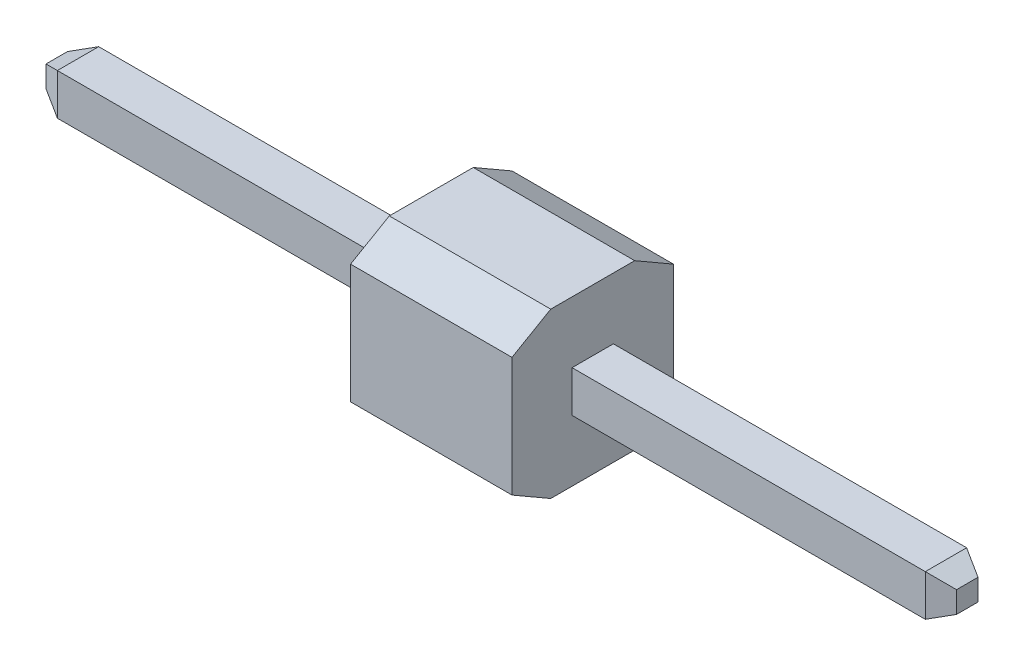
ISO-10303-21;
HEADER;
FILE_DESCRIPTION(('STEP AP214'),'2;1');
FILE_NAME('part.step','',(''),(''),'','','');
FILE_SCHEMA(('AUTOMOTIVE_DESIGN { 1 0 10303 214 1 1 1 1 }'));
ENDSEC;
DATA;
#1=APPLICATION_CONTEXT('core data for automotive mechanical design processes');
#2=APPLICATION_PROTOCOL_DEFINITION('international standard','automotive_design',2000,#1);
#3=PRODUCT_CONTEXT('',#1,'mechanical');
#4=PRODUCT('Part','Part','',(#3));
#5=PRODUCT_RELATED_PRODUCT_CATEGORY('part','',(#4));
#6=PRODUCT_DEFINITION_FORMATION('','',#4);
#7=PRODUCT_DEFINITION_CONTEXT('part definition',#1,'design');
#8=PRODUCT_DEFINITION('design','',#6,#7);
#9=PRODUCT_DEFINITION_SHAPE('','',#8);
#10=(LENGTH_UNIT() NAMED_UNIT(*) SI_UNIT(.MILLI.,.METRE.));
#11=(NAMED_UNIT(*) PLANE_ANGLE_UNIT() SI_UNIT($,.RADIAN.));
#12=(NAMED_UNIT(*) SI_UNIT($,.STERADIAN.) SOLID_ANGLE_UNIT());
#13=UNCERTAINTY_MEASURE_WITH_UNIT(LENGTH_MEASURE(1.E-05),#10,'distance_accuracy_value','');
#14=(GEOMETRIC_REPRESENTATION_CONTEXT(3) GLOBAL_UNCERTAINTY_ASSIGNED_CONTEXT((#13)) GLOBAL_UNIT_ASSIGNED_CONTEXT((#10,
#11,#12)) REPRESENTATION_CONTEXT('',''));
#15=CARTESIAN_POINT('',(0.,0.,0.));
#16=DIRECTION('',(0.,0.,1.));
#17=DIRECTION('',(1.,0.,0.));
#18=AXIS2_PLACEMENT_3D('',#15,#16,#17);
#19=CARTESIAN_POINT('',(5.42107691384192,13.0171157260571,-2.77112170583403));
#20=DIRECTION('',(1.,-9.93476518829084E-08,4.37113882867379E-08));
#21=DIRECTION('',(-9.93476589883358E-08,-1.,8.74227765734759E-08));
#22=AXIS2_PLACEMENT_3D('',#19,#20,#21);
#23=PLANE('',#22);
#24=DIRECTION('',(-1.18186632779335E-08,-0.50000007571054,-0.866025360072934));
#25=VECTOR('',#24,1.);
#26=CARTESIAN_POINT('',(5.42107672166731,11.7735260248209,-1.20112159711595));
#27=LINE('',#26,#25);
#28=CARTESIAN_POINT('',(5.42107672166731,11.7735260248209,-1.20112159711595));
#29=VERTEX_POINT('',#28);
#30=CARTESIAN_POINT('',(5.4210767134791,11.4271158108572,-1.80112156683181));
#31=VERTEX_POINT('',#30);
#32=EDGE_CURVE('E11',#29,#31,#27,.T.);
#33=ORIENTED_EDGE('',*,*,#32,.T.);
#34=DIRECTION('',(4.37113811813104E-08,-8.74227842254741E-08,-0.999999999999995));
#35=VECTOR('',#34,1.);
#36=CARTESIAN_POINT('',(5.4210767134791,11.4271158108572,-1.80112156683181));
#37=LINE('',#36,#35);
#38=CARTESIAN_POINT('',(5.42107677030389,11.4271156972076,-3.10112156683181));
#39=VERTEX_POINT('',#38);
#40=EDGE_CURVE('E304',#31,#39,#37,.T.);
#41=ORIENTED_EDGE('',*,*,#40,.T.);
#42=DIRECTION('',(8.75289963531793E-08,0.499999924289839,-0.866025447495712));
#43=VECTOR('',#42,1.);
#44=CARTESIAN_POINT('',(5.42107677030389,11.4271156972076,-3.10112156683181));
#45=LINE('',#44,#43);
#46=CARTESIAN_POINT('',(5.42107683094576,11.773525806264,-3.70112159711595));
#47=VERTEX_POINT('',#46);
#48=EDGE_CURVE('E296',#39,#47,#45,.T.);
#49=ORIENTED_EDGE('',*,*,#48,.T.);
#50=DIRECTION('',(9.93476588436478E-08,0.999999999999991,-8.74227764822788E-08));
#51=VECTOR('',#50,1.);
#52=CARTESIAN_POINT('',(5.42107683094576,11.773525806264,-3.70112159711595));
#53=LINE('',#52,#51);
#54=CARTESIAN_POINT('',(5.42107701445874,13.620705483234,-3.70112175860153));
#55=VERTEX_POINT('',#54);
#56=EDGE_CURVE('E281',#47,#55,#53,.T.);
#57=ORIENTED_EDGE('',*,*,#56,.T.);
#58=DIRECTION('',(-1.18186632778483E-08,-0.500000075710537,-0.866025360072935));
#59=VECTOR('',#58,1.);
#60=CARTESIAN_POINT('',(5.42107702264695,13.9671156972076,-3.10112178888567));
#61=LINE('',#60,#59);
#62=CARTESIAN_POINT('',(5.42107702264695,13.9671156972076,-3.10112178888567));
#63=VERTEX_POINT('',#62);
#64=EDGE_CURVE('E265',#63,#55,#61,.T.);
#65=ORIENTED_EDGE('',*,*,#64,.F.);
#66=DIRECTION('',(4.37113811813104E-08,-8.74227842254741E-08,-0.999999999999995));
#67=VECTOR('',#66,1.);
#68=CARTESIAN_POINT('',(5.42107696582215,13.9671158108572,-1.80112178888567));
#69=LINE('',#68,#67);
#70=CARTESIAN_POINT('',(5.42107696582215,13.9671158108572,-1.80112178888567));
#71=VERTEX_POINT('',#70);
#72=EDGE_CURVE('E248',#71,#63,#69,.T.);
#73=ORIENTED_EDGE('',*,*,#72,.F.);
#74=DIRECTION('',(8.75289963525477E-08,0.499999924289836,-0.866025447495714));
#75=VECTOR('',#74,1.);
#76=CARTESIAN_POINT('',(5.42107690518028,13.6207057017909,-1.20112175860153));
#77=LINE('',#76,#75);
#78=CARTESIAN_POINT('',(5.42107690518028,13.6207057017909,-1.20112175860153));
#79=VERTEX_POINT('',#78);
#80=EDGE_CURVE('E242',#79,#71,#77,.T.);
#81=ORIENTED_EDGE('',*,*,#80,.F.);
#82=DIRECTION('',(9.93476588436478E-08,0.999999999999991,-8.74227763620714E-08));
#83=VECTOR('',#82,1.);
#84=CARTESIAN_POINT('',(5.42107672166731,11.7735260248209,-1.20112159711595));
#85=LINE('',#84,#83);
#86=EDGE_CURVE('E236',#29,#79,#85,.T.);
#87=ORIENTED_EDGE('',*,*,#86,.F.);
#88=EDGE_LOOP('',(#33,#41,#49,#57,#65,#73,#81,#87));
#89=FACE_BOUND('',#88,.T.);
#90=DIRECTION('',(-4.37113803486431E-08,8.74227856773042E-08,0.999999999999995));
#91=VECTOR('',#90,1.);
#92=CARTESIAN_POINT('',(5.42107685025941,12.3771157260571,-2.77112164988345));
#93=LINE('',#92,#91);
#94=CARTESIAN_POINT('',(5.42107685025941,12.3771157260571,-2.77112164988345));
#95=VERTEX_POINT('',#94);
#96=CARTESIAN_POINT('',(5.42107682228413,12.3771157820077,-2.13112164988345));
#97=VERTEX_POINT('',#96);
#98=EDGE_CURVE('E302',#95,#97,#93,.T.);
#99=ORIENTED_EDGE('',*,*,#98,.T.);
#100=DIRECTION('',(-9.93476578781123E-08,-0.999999999999991,8.74227766567422E-08));
#101=VECTOR('',#100,1.);
#102=CARTESIAN_POINT('',(5.42107688586663,13.0171157820077,-2.13112170583403));
#103=LINE('',#102,#101);
#104=CARTESIAN_POINT('',(5.42107688586663,13.0171157820077,-2.13112170583403));
#105=VERTEX_POINT('',#104);
#106=EDGE_CURVE('E293',#105,#97,#103,.T.);
#107=ORIENTED_EDGE('',*,*,#106,.F.);
#108=DIRECTION('',(-4.37113817364219E-08,8.74227856773042E-08,0.999999999999995));
#109=VECTOR('',#108,1.);
#110=CARTESIAN_POINT('',(5.42107691384192,13.0171157260571,-2.77112170583403));
#111=LINE('',#110,#109);
#112=CARTESIAN_POINT('',(5.42107691384192,13.0171157260571,-2.77112170583403));
#113=VERTEX_POINT('',#112);
#114=EDGE_CURVE('E278',#113,#105,#111,.T.);
#115=ORIENTED_EDGE('',*,*,#114,.F.);
#116=DIRECTION('',(-9.93476592658911E-08,-0.999999999999991,8.74227766567422E-08));
#117=VECTOR('',#116,1.);
#118=CARTESIAN_POINT('',(5.42107691384192,13.0171157260571,-2.77112170583403));
#119=LINE('',#118,#117);
#120=EDGE_CURVE('E263',#113,#95,#119,.T.);
#121=ORIENTED_EDGE('',*,*,#120,.T.);
#122=EDGE_LOOP('',(#99,#107,#115,#121));
#123=FACE_BOUND('',#122,.T.);
#124=ADVANCED_FACE('F17',(#89,#123),#23,.T.);
#125=CARTESIAN_POINT('',(2.92107691384192,13.0171159744263,-2.7711218151125));
#126=DIRECTION('',(1.,-9.93476518829084E-08,4.37113882867379E-08));
#127=DIRECTION('',(-9.93476589883358E-08,-1.,8.74227765734759E-08));
#128=AXIS2_PLACEMENT_3D('',#125,#126,#127);
#129=PLANE('',#128);
#130=DIRECTION('',(-1.1818662636946E-08,-0.50000007571054,-0.866025360072934));
#131=VECTOR('',#130,1.);
#132=CARTESIAN_POINT('',(2.92107672166731,11.77352627319,-1.20112170639442));
#133=LINE('',#132,#131);
#134=CARTESIAN_POINT('',(2.92107672166731,11.77352627319,-1.20112170639442));
#135=VERTEX_POINT('',#134);
#136=CARTESIAN_POINT('',(2.9210767134791,11.4271160592264,-1.80112167611028));
#137=VERTEX_POINT('',#136);
#138=EDGE_CURVE('E24',#135,#137,#133,.T.);
#139=ORIENTED_EDGE('',*,*,#138,.F.);
#140=DIRECTION('',(9.93476590840625E-08,0.999999999999991,-8.74227763620714E-08));
#141=VECTOR('',#140,1.);
#142=CARTESIAN_POINT('',(2.92107672166731,11.77352627319,-1.20112170639442));
#143=LINE('',#142,#141);
#144=CARTESIAN_POINT('',(2.92107690518028,13.62070595016,-1.20112186788));
#145=VERTEX_POINT('',#144);
#146=EDGE_CURVE('E300',#135,#145,#143,.T.);
#147=ORIENTED_EDGE('',*,*,#146,.T.);
#148=DIRECTION('',(8.75289957115602E-08,0.499999924289836,-0.866025447495714));
#149=VECTOR('',#148,1.);
#150=CARTESIAN_POINT('',(2.92107690518028,13.62070595016,-1.20112186788));
#151=LINE('',#150,#149);
#152=CARTESIAN_POINT('',(2.92107696582215,13.9671160592264,-1.80112189816414));
#153=VERTEX_POINT('',#152);
#154=EDGE_CURVE('E286',#145,#153,#151,.T.);
#155=ORIENTED_EDGE('',*,*,#154,.T.);
#156=DIRECTION('',(4.37113811813104E-08,-8.74227842254741E-08,-0.999999999999995));
#157=VECTOR('',#156,1.);
#158=CARTESIAN_POINT('',(2.92107696582215,13.9671160592264,-1.80112189816414));
#159=LINE('',#158,#157);
#160=CARTESIAN_POINT('',(2.92107702264695,13.9671159455768,-3.10112189816414));
#161=VERTEX_POINT('',#160);
#162=EDGE_CURVE('E271',#153,#161,#159,.T.);
#163=ORIENTED_EDGE('',*,*,#162,.T.);
#164=DIRECTION('',(-1.18186626368607E-08,-0.500000075710537,-0.866025360072935));
#165=VECTOR('',#164,1.);
#166=CARTESIAN_POINT('',(2.92107702264695,13.9671159455768,-3.10112189816414));
#167=LINE('',#166,#165);
#168=CARTESIAN_POINT('',(2.92107701445874,13.6207057316031,-3.70112186788));
#169=VERTEX_POINT('',#168);
#170=EDGE_CURVE('E253',#161,#169,#167,.T.);
#171=ORIENTED_EDGE('',*,*,#170,.T.);
#172=DIRECTION('',(9.93476590840625E-08,0.999999999999991,-8.74227764822788E-08));
#173=VECTOR('',#172,1.);
#174=CARTESIAN_POINT('',(2.92107683094576,11.7735260546331,-3.70112170639442));
#175=LINE('',#174,#173);
#176=CARTESIAN_POINT('',(2.92107683094576,11.7735260546331,-3.70112170639442));
#177=VERTEX_POINT('',#176);
#178=EDGE_CURVE('E261',#177,#169,#175,.T.);
#179=ORIENTED_EDGE('',*,*,#178,.F.);
#180=DIRECTION('',(8.75289957121918E-08,0.499999924289839,-0.866025447495712));
#181=VECTOR('',#180,1.);
#182=CARTESIAN_POINT('',(2.92107677030389,11.4271159455767,-3.10112167611028));
#183=LINE('',#182,#181);
#184=CARTESIAN_POINT('',(2.92107677030389,11.4271159455767,-3.10112167611028));
#185=VERTEX_POINT('',#184);
#186=EDGE_CURVE('E276',#185,#177,#183,.T.);
#187=ORIENTED_EDGE('',*,*,#186,.F.);
#188=DIRECTION('',(4.37113811813104E-08,-8.74227842254741E-08,-0.999999999999995));
#189=VECTOR('',#188,1.);
#190=CARTESIAN_POINT('',(2.9210767134791,11.4271160592264,-1.80112167611028));
#191=LINE('',#190,#189);
#192=EDGE_CURVE('E291',#137,#185,#191,.T.);
#193=ORIENTED_EDGE('',*,*,#192,.F.);
#194=EDGE_LOOP('',(#139,#147,#155,#163,#171,#179,#187,#193));
#195=FACE_BOUND('',#194,.T.);
#196=DIRECTION('',(-9.93476592658911E-08,-0.999999999999991,8.74227766567422E-08));
#197=VECTOR('',#196,1.);
#198=CARTESIAN_POINT('',(2.92107688586663,13.0171160303769,-2.1311218151125));
#199=LINE('',#198,#197);
#200=CARTESIAN_POINT('',(2.92107688586663,13.0171160303769,-2.1311218151125));
#201=VERTEX_POINT('',#200);
#202=CARTESIAN_POINT('',(2.92107682228413,12.3771160303769,-2.13112175916192));
#203=VERTEX_POINT('',#202);
#204=EDGE_CURVE('E298',#201,#203,#199,.T.);
#205=ORIENTED_EDGE('',*,*,#204,.T.);
#206=DIRECTION('',(-4.37113810425325E-08,8.74227856773042E-08,0.999999999999995));
#207=VECTOR('',#206,1.);
#208=CARTESIAN_POINT('',(2.92107685025941,12.3771159744263,-2.77112175916192));
#209=LINE('',#208,#207);
#210=CARTESIAN_POINT('',(2.92107685025941,12.3771159744263,-2.77112175916192));
#211=VERTEX_POINT('',#210);
#212=EDGE_CURVE('E283',#211,#203,#209,.T.);
#213=ORIENTED_EDGE('',*,*,#212,.F.);
#214=DIRECTION('',(-9.93476592658911E-08,-0.999999999999991,8.74227766567422E-08));
#215=VECTOR('',#214,1.);
#216=CARTESIAN_POINT('',(2.92107691384192,13.0171159744263,-2.7711218151125));
#217=LINE('',#216,#215);
#218=CARTESIAN_POINT('',(2.92107691384192,13.0171159744263,-2.7711218151125));
#219=VERTEX_POINT('',#218);
#220=EDGE_CURVE('E268',#219,#211,#217,.T.);
#221=ORIENTED_EDGE('',*,*,#220,.F.);
#222=DIRECTION('',(-4.37113810425325E-08,8.74227856773042E-08,0.999999999999995));
#223=VECTOR('',#222,1.);
#224=CARTESIAN_POINT('',(2.92107691384192,13.0171159744263,-2.7711218151125));
#225=LINE('',#224,#223);
#226=EDGE_CURVE('E251',#219,#201,#225,.T.);
#227=ORIENTED_EDGE('',*,*,#226,.T.);
#228=EDGE_LOOP('',(#205,#213,#221,#227));
#229=FACE_BOUND('',#228,.T.);
#230=ADVANCED_FACE('F314',(#195,#229),#129,.F.);
#231=CARTESIAN_POINT('',(5.42107672166731,11.7735260248209,-1.20112159711595));
#232=DIRECTION('',(1.07893287081065E-07,0.866025360072937,-0.500000075710535));
#233=DIRECTION('',(1.18186629566715E-08,0.500000075710542,0.866025360072941));
#234=AXIS2_PLACEMENT_3D('',#231,#232,#233);
#235=PLANE('',#234);
#236=ORIENTED_EDGE('',*,*,#138,.T.);
#237=DIRECTION('',(-0.999999999999994,9.93476533039933E-08,-4.37113883755555E-08));
#238=VECTOR('',#237,1.);
#239=CARTESIAN_POINT('',(5.4210767134791,11.4271158108572,-1.80112156683181));
#240=LINE('',#239,#238);
#241=EDGE_CURVE('E288',#31,#137,#240,.T.);
#242=ORIENTED_EDGE('',*,*,#241,.F.);
#243=ORIENTED_EDGE('',*,*,#32,.F.);
#244=DIRECTION('',(-0.999999999999994,9.93476504618223E-08,-4.3711388109102E-08));
#245=VECTOR('',#244,1.);
#246=CARTESIAN_POINT('',(5.42107672166731,11.7735260248209,-1.20112159711595));
#247=LINE('',#246,#245);
#248=EDGE_CURVE('E256',#29,#135,#247,.T.);
#249=ORIENTED_EDGE('',*,*,#248,.T.);
#250=EDGE_LOOP('',(#236,#242,#243,#249));
#251=FACE_BOUND('',#250,.T.);
#252=ADVANCED_FACE('F306',(#251),#235,.F.);
#253=CARTESIAN_POINT('',(5.4210767134791,11.4271158108572,-1.80112156683181));
#254=DIRECTION('',(9.93476589883358E-08,1.,-8.74227765734759E-08));
#255=DIRECTION('',(1.,-9.93476518829084E-08,4.37113882867379E-08));
#256=AXIS2_PLACEMENT_3D('',#253,#254,#255);
#257=PLANE('',#256);
#258=ORIENTED_EDGE('',*,*,#192,.T.);
#259=DIRECTION('',(-0.999999999999994,9.93476533039933E-08,-4.37113884643734E-08));
#260=VECTOR('',#259,1.);
#261=CARTESIAN_POINT('',(5.42107677030389,11.4271156972076,-3.10112156683181));
#262=LINE('',#261,#260);
#263=EDGE_CURVE('E273',#39,#185,#262,.T.);
#264=ORIENTED_EDGE('',*,*,#263,.F.);
#265=ORIENTED_EDGE('',*,*,#40,.F.);
#266=ORIENTED_EDGE('',*,*,#241,.T.);
#267=EDGE_LOOP('',(#258,#264,#265,#266));
#268=FACE_BOUND('',#267,.T.);
#269=ADVANCED_FACE('F311',(#268),#257,.F.);
#270=CARTESIAN_POINT('',(5.42107677030389,11.4271156972076,-3.10112156683181));
#271=DIRECTION('',(6.41819058997377E-08,0.866025447495721,0.499999924289845));
#272=DIRECTION('',(-8.7528996031702E-08,-0.499999924289838,0.866025447495717));
#273=AXIS2_PLACEMENT_3D('',#270,#271,#272);
#274=PLANE('',#273);
#275=ORIENTED_EDGE('',*,*,#186,.T.);
#276=DIRECTION('',(-0.999999999999994,9.93476504618223E-08,-4.37113882867377E-08));
#277=VECTOR('',#276,1.);
#278=CARTESIAN_POINT('',(5.42107683094576,11.773525806264,-3.70112159711595));
#279=LINE('',#278,#277);
#280=EDGE_CURVE('E258',#47,#177,#279,.T.);
#281=ORIENTED_EDGE('',*,*,#280,.F.);
#282=ORIENTED_EDGE('',*,*,#48,.F.);
#283=ORIENTED_EDGE('',*,*,#263,.T.);
#284=EDGE_LOOP('',(#275,#281,#282,#283));
#285=FACE_BOUND('',#284,.T.);
#286=ADVANCED_FACE('F319',(#285),#274,.F.);
#287=CARTESIAN_POINT('',(5.42107683094576,11.773525806264,-3.70112159711595));
#288=DIRECTION('',(-4.37113811813106E-08,8.74227836789032E-08,1.));
#289=DIRECTION('',(-1.,9.93476518829084E-08,-4.37113882867379E-08));
#290=AXIS2_PLACEMENT_3D('',#287,#288,#289);
#291=PLANE('',#290);
#292=ORIENTED_EDGE('',*,*,#178,.T.);
#293=DIRECTION('',(-0.999999999999994,9.93476533039933E-08,-4.37113884643734E-08));
#294=VECTOR('',#293,1.);
#295=CARTESIAN_POINT('',(5.42107701445874,13.620705483234,-3.70112175860153));
#296=LINE('',#295,#294);
#297=EDGE_CURVE('E245',#55,#169,#296,.T.);
#298=ORIENTED_EDGE('',*,*,#297,.F.);
#299=ORIENTED_EDGE('',*,*,#56,.F.);
#300=ORIENTED_EDGE('',*,*,#280,.T.);
#301=EDGE_LOOP('',(#292,#298,#299,#300));
#302=FACE_BOUND('',#301,.T.);
#303=ADVANCED_FACE('F326',(#302),#291,.F.);
#304=CARTESIAN_POINT('',(5.42107702264695,13.9671156972076,-3.10112178888567));
#305=DIRECTION('',(1.07893287081065E-07,0.866025360072937,-0.500000075710535));
#306=DIRECTION('',(1.18186629566715E-08,0.500000075710542,0.866025360072941));
#307=AXIS2_PLACEMENT_3D('',#304,#305,#306);
#308=PLANE('',#307);
#309=ORIENTED_EDGE('',*,*,#170,.F.);
#310=DIRECTION('',(-0.999999999999994,9.93476490407369E-08,-4.37113882867377E-08));
#311=VECTOR('',#310,1.);
#312=CARTESIAN_POINT('',(5.42107702264695,13.9671156972076,-3.10112178888567));
#313=LINE('',#312,#311);
#314=EDGE_CURVE('E239',#63,#161,#313,.T.);
#315=ORIENTED_EDGE('',*,*,#314,.F.);
#316=ORIENTED_EDGE('',*,*,#64,.T.);
#317=ORIENTED_EDGE('',*,*,#297,.T.);
#318=EDGE_LOOP('',(#309,#315,#316,#317));
#319=FACE_BOUND('',#318,.T.);
#320=ADVANCED_FACE('F329',(#319),#308,.T.);
#321=CARTESIAN_POINT('',(5.42107696582215,13.9671158108572,-1.80112178888567));
#322=DIRECTION('',(9.93476589883358E-08,1.,-8.74227765734759E-08));
#323=DIRECTION('',(1.,-9.93476518829084E-08,4.37113882867379E-08));
#324=AXIS2_PLACEMENT_3D('',#321,#322,#323);
#325=PLANE('',#324);
#326=ORIENTED_EDGE('',*,*,#162,.F.);
#327=DIRECTION('',(-0.999999999999994,9.93476490407369E-08,-4.37113882867377E-08));
#328=VECTOR('',#327,1.);
#329=CARTESIAN_POINT('',(5.42107696582215,13.9671158108572,-1.80112178888567));
#330=LINE('',#329,#328);
#331=EDGE_CURVE('E233',#71,#153,#330,.T.);
#332=ORIENTED_EDGE('',*,*,#331,.F.);
#333=ORIENTED_EDGE('',*,*,#72,.T.);
#334=ORIENTED_EDGE('',*,*,#314,.T.);
#335=EDGE_LOOP('',(#326,#332,#333,#334));
#336=FACE_BOUND('',#335,.T.);
#337=ADVANCED_FACE('F333',(#336),#325,.T.);
#338=CARTESIAN_POINT('',(5.42107690518028,13.6207057017909,-1.20112175860153));
#339=DIRECTION('',(6.41819058997377E-08,0.866025447495721,0.499999924289845));
#340=DIRECTION('',(-8.7528996031702E-08,-0.499999924289838,0.866025447495717));
#341=AXIS2_PLACEMENT_3D('',#338,#339,#340);
#342=PLANE('',#341);
#343=ORIENTED_EDGE('',*,*,#154,.F.);
#344=DIRECTION('',(-0.999999999999994,9.93476533039933E-08,-4.3711388109102E-08));
#345=VECTOR('',#344,1.);
#346=CARTESIAN_POINT('',(5.42107690518028,13.6207057017909,-1.20112175860153));
#347=LINE('',#346,#345);
#348=EDGE_CURVE('E230',#79,#145,#347,.T.);
#349=ORIENTED_EDGE('',*,*,#348,.F.);
#350=ORIENTED_EDGE('',*,*,#80,.T.);
#351=ORIENTED_EDGE('',*,*,#331,.T.);
#352=EDGE_LOOP('',(#343,#349,#350,#351));
#353=FACE_BOUND('',#352,.T.);
#354=ADVANCED_FACE('F337',(#353),#342,.T.);
#355=CARTESIAN_POINT('',(5.42107672166731,11.7735260248209,-1.20112159711595));
#356=DIRECTION('',(-4.37113811813106E-08,8.74227835615132E-08,1.));
#357=DIRECTION('',(-9.93476589883358E-08,-1.,8.74227764560859E-08));
#358=AXIS2_PLACEMENT_3D('',#355,#356,#357);
#359=PLANE('',#358);
#360=ORIENTED_EDGE('',*,*,#146,.F.);
#361=ORIENTED_EDGE('',*,*,#248,.F.);
#362=ORIENTED_EDGE('',*,*,#86,.T.);
#363=ORIENTED_EDGE('',*,*,#348,.T.);
#364=EDGE_LOOP('',(#360,#361,#362,#363));
#365=FACE_BOUND('',#364,.T.);
#366=ADVANCED_FACE('F339',(#365),#359,.T.);
#367=CARTESIAN_POINT('',(-2.87892308615808,13.0171165506426,-2.77112206863855));
#368=DIRECTION('',(-1.,9.93476518829084E-08,-4.37113882867379E-08));
#369=DIRECTION('',(9.93476589883358E-08,1.,-8.74227765734759E-08));
#370=AXIS2_PLACEMENT_3D('',#367,#368,#369);
#371=PLANE('',#370);
#372=DIRECTION('',(9.93476608211201E-08,0.999999999999991,-8.7422776141512E-08));
#373=VECTOR('',#372,1.);
#374=CARTESIAN_POINT('',(-2.87892315570173,12.5309981203305,-2.28500355333172));
#375=LINE('',#374,#373);
#376=CARTESIAN_POINT('',(-2.87892315570173,12.5309981203305,-2.28500355333172));
#377=VERTEX_POINT('',#376);
#378=CARTESIAN_POINT('',(-2.87892312269476,12.8632350659405,-2.2850035823768));
#379=VERTEX_POINT('',#378);
#380=EDGE_CURVE('E228',#377,#379,#375,.T.);
#381=ORIENTED_EDGE('',*,*,#380,.T.);
#382=DIRECTION('',(4.37113820547149E-08,-8.74227748027428E-08,-0.999999999999995));
#383=VECTOR('',#382,1.);
#384=CARTESIAN_POINT('',(-2.87892312269477,12.8632350659405,-2.2850035823768));
#385=LINE('',#384,#383);
#386=CARTESIAN_POINT('',(-2.87892310817223,12.8632350368954,-2.6172405279948));
#387=VERTEX_POINT('',#386);
#388=EDGE_CURVE('E223',#379,#387,#385,.T.);
#389=ORIENTED_EDGE('',*,*,#388,.T.);
#390=DIRECTION('',(-9.93476581477919E-08,-0.999999999999991,8.74227774781761E-08));
#391=VECTOR('',#390,1.);
#392=CARTESIAN_POINT('',(-2.87892310817223,12.8632350368954,-2.6172405279948));
#393=LINE('',#392,#391);
#394=CARTESIAN_POINT('',(-2.87892314117919,12.5309980912854,-2.61724049894973));
#395=VERTEX_POINT('',#394);
#396=EDGE_CURVE('E215',#387,#395,#393,.T.);
#397=ORIENTED_EDGE('',*,*,#396,.T.);
#398=DIRECTION('',(-4.37113740347301E-08,8.7422774802743E-08,0.999999999999995));
#399=VECTOR('',#398,1.);
#400=CARTESIAN_POINT('',(-2.87892314117919,12.5309980912854,-2.61724049894973));
#401=LINE('',#400,#399);
#402=EDGE_CURVE('E207',#395,#377,#401,.T.);
#403=ORIENTED_EDGE('',*,*,#402,.T.);
#404=EDGE_LOOP('',(#381,#389,#397,#403));
#405=FACE_BOUND('',#404,.T.);
#406=ADVANCED_FACE('F341',(#405),#371,.T.);
#407=CARTESIAN_POINT('',(-2.87892308615808,13.0171165506426,-2.77112206863855));
#408=DIRECTION('',(9.93476589883358E-08,1.,-8.74227764510112E-08));
#409=DIRECTION('',(-4.37113811813106E-08,8.74227835564385E-08,1.));
#410=AXIS2_PLACEMENT_3D('',#407,#408,#409);
#411=PLANE('',#410);
#412=DIRECTION('',(0.999999999999994,-9.93476508047534E-08,4.37113882769953E-08));
#413=VECTOR('',#412,1.);
#414=CARTESIAN_POINT('',(-2.54892308615808,13.0171165178579,-2.77112205421379));
#415=LINE('',#414,#413);
#416=CARTESIAN_POINT('',(-2.54892308615808,13.0171165178579,-2.77112205421379));
#417=VERTEX_POINT('',#416);
#418=EDGE_CURVE('E225',#417,#219,#415,.T.);
#419=ORIENTED_EDGE('',*,*,#418,.F.);
#420=DIRECTION('',(-4.37113817364219E-08,8.74227856773042E-08,0.999999999999995));
#421=VECTOR('',#420,1.);
#422=CARTESIAN_POINT('',(-2.54892308615808,13.0171165178579,-2.77112205421379));
#423=LINE('',#422,#421);
#424=CARTESIAN_POINT('',(-2.54892311413337,13.0171165738085,-2.13112205421379));
#425=VERTEX_POINT('',#424);
#426=EDGE_CURVE('E217',#417,#425,#423,.T.);
#427=ORIENTED_EDGE('',*,*,#426,.T.);
#428=DIRECTION('',(0.999999999999994,-9.93476508047534E-08,4.3711388195809E-08));
#429=VECTOR('',#428,1.);
#430=CARTESIAN_POINT('',(-2.54892311413337,13.0171165738085,-2.13112205421379));
#431=LINE('',#430,#429);
#432=EDGE_CURVE('E220',#425,#201,#431,.T.);
#433=ORIENTED_EDGE('',*,*,#432,.T.);
#434=ORIENTED_EDGE('',*,*,#226,.F.);
#435=EDGE_LOOP('',(#419,#427,#433,#434));
#436=FACE_BOUND('',#435,.T.);
#437=ADVANCED_FACE('F348',(#436),#411,.T.);
#438=CARTESIAN_POINT('',(-2.87892311413337,13.0171166065932,-2.13112206863855));
#439=DIRECTION('',(-4.37113811813106E-08,8.74227836789032E-08,1.));
#440=DIRECTION('',(-1.,9.93476518829084E-08,-4.37113882867379E-08));
#441=AXIS2_PLACEMENT_3D('',#438,#439,#440);
#442=PLANE('',#441);
#443=ORIENTED_EDGE('',*,*,#432,.F.);
#444=DIRECTION('',(-9.93476578781123E-08,-0.999999999999991,8.74227766567422E-08));
#445=VECTOR('',#444,1.);
#446=CARTESIAN_POINT('',(-2.54892311413337,13.0171165738085,-2.13112205421379));
#447=LINE('',#446,#445);
#448=CARTESIAN_POINT('',(-2.54892317771587,12.3771165738085,-2.13112199826322));
#449=VERTEX_POINT('',#448);
#450=EDGE_CURVE('E209',#425,#449,#447,.T.);
#451=ORIENTED_EDGE('',*,*,#450,.T.);
#452=DIRECTION('',(0.999999999999994,-9.93476508047534E-08,4.3711388195809E-08));
#453=VECTOR('',#452,1.);
#454=CARTESIAN_POINT('',(-2.54892317771587,12.3771165738085,-2.13112199826322));
#455=LINE('',#454,#453);
#456=EDGE_CURVE('E212',#449,#203,#455,.T.);
#457=ORIENTED_EDGE('',*,*,#456,.T.);
#458=ORIENTED_EDGE('',*,*,#204,.F.);
#459=EDGE_LOOP('',(#443,#451,#457,#458));
#460=FACE_BOUND('',#459,.T.);
#461=ADVANCED_FACE('F424',(#460),#442,.T.);
#462=CARTESIAN_POINT('',(-2.87892314974059,12.3771165506427,-2.77112201268797));
#463=DIRECTION('',(9.93476589883357E-08,1.,-8.74227764040693E-08));
#464=DIRECTION('',(-4.37113811813106E-08,8.74227835094966E-08,1.));
#465=AXIS2_PLACEMENT_3D('',#462,#463,#464);
#466=PLANE('',#465);
#467=ORIENTED_EDGE('',*,*,#456,.F.);
#468=DIRECTION('',(4.37113817364219E-08,-8.74227912284193E-08,-0.999999999999995));
#469=VECTOR('',#468,1.);
#470=CARTESIAN_POINT('',(-2.54892317771587,12.3771165738085,-2.13112199826322));
#471=LINE('',#470,#469);
#472=CARTESIAN_POINT('',(-2.54892314974059,12.3771165178579,-2.77112199826322));
#473=VERTEX_POINT('',#472);
#474=EDGE_CURVE('E201',#449,#473,#471,.T.);
#475=ORIENTED_EDGE('',*,*,#474,.T.);
#476=DIRECTION('',(0.999999999999994,-9.93476508047534E-08,4.37113882769953E-08));
#477=VECTOR('',#476,1.);
#478=CARTESIAN_POINT('',(-2.54892314974059,12.3771165178579,-2.77112199826322));
#479=LINE('',#478,#477);
#480=EDGE_CURVE('E204',#473,#211,#479,.T.);
#481=ORIENTED_EDGE('',*,*,#480,.T.);
#482=ORIENTED_EDGE('',*,*,#212,.T.);
#483=EDGE_LOOP('',(#467,#475,#481,#482));
#484=FACE_BOUND('',#483,.T.);
#485=ADVANCED_FACE('F421',(#484),#466,.F.);
#486=CARTESIAN_POINT('',(-2.87892308615808,13.0171165506426,-2.77112206863855));
#487=DIRECTION('',(-4.37113811813106E-08,8.74227836789032E-08,1.));
#488=DIRECTION('',(-1.,9.93476518829084E-08,-4.37113882867379E-08));
#489=AXIS2_PLACEMENT_3D('',#486,#487,#488);
#490=PLANE('',#489);
#491=ORIENTED_EDGE('',*,*,#480,.F.);
#492=DIRECTION('',(9.93476578781123E-08,0.999999999999991,-8.74227766567422E-08));
#493=VECTOR('',#492,1.);
#494=CARTESIAN_POINT('',(-2.54892314974059,12.3771165178579,-2.77112199826322));
#495=LINE('',#494,#493);
#496=EDGE_CURVE('E196',#473,#417,#495,.T.);
#497=ORIENTED_EDGE('',*,*,#496,.T.);
#498=ORIENTED_EDGE('',*,*,#418,.T.);
#499=ORIENTED_EDGE('',*,*,#220,.T.);
#500=EDGE_LOOP('',(#491,#497,#498,#499));
#501=FACE_BOUND('',#500,.T.);
#502=ADVANCED_FACE('F376',(#501),#490,.F.);
#503=CARTESIAN_POINT('',(-2.87892308615808,13.0171165506426,-2.77112206863855));
#504=DIRECTION('',(-4.37113811813106E-08,8.74227836789032E-08,1.));
#505=DIRECTION('',(-1.,9.93476518829084E-08,-4.37113882867379E-08));
#506=AXIS2_PLACEMENT_3D('',#503,#504,#505);
#507=PLANE('',#506);
#508=DIRECTION('',(0.999999999999994,-9.93476417118848E-08,4.37113882769953E-08));
#509=VECTOR('',#508,1.);
#510=CARTESIAN_POINT('',(5.42107691384192,13.0171157260571,-2.77112170583403));
#511=LINE('',#510,#509);
#512=CARTESIAN_POINT('',(10.8910769138419,13.0171151826255,-2.77112146673274));
#513=VERTEX_POINT('',#512);
#514=EDGE_CURVE('E199',#113,#513,#511,.T.);
#515=ORIENTED_EDGE('',*,*,#514,.T.);
#516=DIRECTION('',(-9.93476578781123E-08,-0.999999999999991,8.74227766567422E-08));
#517=VECTOR('',#516,1.);
#518=CARTESIAN_POINT('',(10.8910769138419,13.0171151826255,-2.77112146673274));
#519=LINE('',#518,#517);
#520=CARTESIAN_POINT('',(10.8910768502594,12.3771151826255,-2.77112141078216));
#521=VERTEX_POINT('',#520);
#522=EDGE_CURVE('E191',#513,#521,#519,.T.);
#523=ORIENTED_EDGE('',*,*,#522,.T.);
#524=DIRECTION('',(0.999999999999994,-9.93476572996596E-08,4.37113882769953E-08));
#525=VECTOR('',#524,1.);
#526=CARTESIAN_POINT('',(5.42107685025941,12.3771157260572,-2.77112164988345));
#527=LINE('',#526,#525);
#528=EDGE_CURVE('E194',#95,#521,#527,.T.);
#529=ORIENTED_EDGE('',*,*,#528,.F.);
#530=ORIENTED_EDGE('',*,*,#120,.F.);
#531=EDGE_LOOP('',(#515,#523,#529,#530));
#532=FACE_BOUND('',#531,.T.);
#533=ADVANCED_FACE('F367',(#532),#507,.F.);
#534=CARTESIAN_POINT('',(-2.87892314974059,12.3771165506427,-2.77112201268797));
#535=DIRECTION('',(9.93476589883357E-08,1.,-8.74227764040693E-08));
#536=DIRECTION('',(-4.37113811813106E-08,8.74227835094966E-08,1.));
#537=AXIS2_PLACEMENT_3D('',#534,#535,#536);
#538=PLANE('',#537);
#539=ORIENTED_EDGE('',*,*,#528,.T.);
#540=DIRECTION('',(-4.37113817364219E-08,8.74227856773042E-08,0.999999999999995));
#541=VECTOR('',#540,1.);
#542=CARTESIAN_POINT('',(10.8910768502594,12.3771151826255,-2.77112141078216));
#543=LINE('',#542,#541);
#544=CARTESIAN_POINT('',(10.8910768222841,12.3771152385761,-2.13112141078216));
#545=VERTEX_POINT('',#544);
#546=EDGE_CURVE('E186',#521,#545,#543,.T.);
#547=ORIENTED_EDGE('',*,*,#546,.T.);
#548=DIRECTION('',(0.999999999999994,-9.93476572996596E-08,4.37113881146227E-08));
#549=VECTOR('',#548,1.);
#550=CARTESIAN_POINT('',(5.42107682228413,12.3771157820077,-2.13112164988345));
#551=LINE('',#550,#549);
#552=EDGE_CURVE('E189',#97,#545,#551,.T.);
#553=ORIENTED_EDGE('',*,*,#552,.F.);
#554=ORIENTED_EDGE('',*,*,#98,.F.);
#555=EDGE_LOOP('',(#539,#547,#553,#554));
#556=FACE_BOUND('',#555,.T.);
#557=ADVANCED_FACE('F364',(#556),#538,.F.);
#558=CARTESIAN_POINT('',(-2.87892311413337,13.0171166065932,-2.13112206863855));
#559=DIRECTION('',(-4.37113811813106E-08,8.74227836789032E-08,1.));
#560=DIRECTION('',(-1.,9.93476518829084E-08,-4.37113882867379E-08));
#561=AXIS2_PLACEMENT_3D('',#558,#559,#560);
#562=PLANE('',#561);
#563=ORIENTED_EDGE('',*,*,#552,.T.);
#564=DIRECTION('',(9.93476606536699E-08,0.999999999999991,-8.74227766567422E-08));
#565=VECTOR('',#564,1.);
#566=CARTESIAN_POINT('',(10.8910768222841,12.3771152385761,-2.13112141078216));
#567=LINE('',#566,#565);
#568=CARTESIAN_POINT('',(10.8910768858666,13.0171152385761,-2.13112146673274));
#569=VERTEX_POINT('',#568);
#570=EDGE_CURVE('E176',#545,#569,#567,.T.);
#571=ORIENTED_EDGE('',*,*,#570,.T.);
#572=DIRECTION('',(0.999999999999994,-9.93476417118848E-08,4.37113881146227E-08));
#573=VECTOR('',#572,1.);
#574=CARTESIAN_POINT('',(5.42107688586663,13.0171157820077,-2.13112170583403));
#575=LINE('',#574,#573);
#576=EDGE_CURVE('E179',#105,#569,#575,.T.);
#577=ORIENTED_EDGE('',*,*,#576,.F.);
#578=ORIENTED_EDGE('',*,*,#106,.T.);
#579=EDGE_LOOP('',(#563,#571,#577,#578));
#580=FACE_BOUND('',#579,.T.);
#581=ADVANCED_FACE('F366',(#580),#562,.T.);
#582=CARTESIAN_POINT('',(-2.87892308615808,13.0171165506426,-2.77112206863855));
#583=DIRECTION('',(9.93476589883358E-08,1.,-8.74227764510112E-08));
#584=DIRECTION('',(-4.37113811813106E-08,8.74227835564385E-08,1.));
#585=AXIS2_PLACEMENT_3D('',#582,#583,#584);
#586=PLANE('',#585);
#587=ORIENTED_EDGE('',*,*,#576,.T.);
#588=DIRECTION('',(4.37113789608643E-08,-8.74227856773042E-08,-0.999999999999995));
#589=VECTOR('',#588,1.);
#590=CARTESIAN_POINT('',(10.8910768858666,13.0171152385761,-2.13112146673274));
#591=LINE('',#590,#589);
#592=EDGE_CURVE('E167',#569,#513,#591,.T.);
#593=ORIENTED_EDGE('',*,*,#592,.T.);
#594=ORIENTED_EDGE('',*,*,#514,.F.);
#595=ORIENTED_EDGE('',*,*,#114,.T.);
#596=EDGE_LOOP('',(#587,#593,#594,#595));
#597=FACE_BOUND('',#596,.T.);
#598=ADVANCED_FACE('F373',(#597),#586,.T.);
#599=CARTESIAN_POINT('',(11.2210769138419,13.0171151498408,-2.77112145230798));
#600=DIRECTION('',(-1.,9.93476518829084E-08,-4.37113882867379E-08));
#601=DIRECTION('',(9.93476589883358E-08,1.,-8.74227765734759E-08));
#602=AXIS2_PLACEMENT_3D('',#599,#600,#601);
#603=PLANE('',#602);
#604=DIRECTION('',(-9.93476581477919E-08,-0.999999999999991,8.74227774781761E-08));
#605=VECTOR('',#604,1.);
#606=CARTESIAN_POINT('',(11.2210768773052,12.8632336651386,-2.28500296604623));
#607=LINE('',#606,#605);
#608=CARTESIAN_POINT('',(11.2210768773052,12.8632336651386,-2.28500296604623));
#609=VERTEX_POINT('',#608);
#610=CARTESIAN_POINT('',(11.2210768442983,12.5309967195286,-2.28500293700115));
#611=VERTEX_POINT('',#610);
#612=EDGE_CURVE('E153',#609,#611,#607,.T.);
#613=ORIENTED_EDGE('',*,*,#612,.T.);
#614=DIRECTION('',(4.37113820547149E-08,-8.74228068826821E-08,-0.999999999999995));
#615=VECTOR('',#614,1.);
#616=CARTESIAN_POINT('',(11.2210768442983,12.5309967195286,-2.28500293700115));
#617=LINE('',#616,#615);
#618=CARTESIAN_POINT('',(11.2210768588208,12.5309966904835,-2.61723988261915));
#619=VERTEX_POINT('',#618);
#620=EDGE_CURVE('E395',#611,#619,#617,.T.);
#621=ORIENTED_EDGE('',*,*,#620,.T.);
#622=DIRECTION('',(9.93476581477919E-08,0.999999999999991,-8.7422776141512E-08));
#623=VECTOR('',#622,1.);
#624=CARTESIAN_POINT('',(11.2210768588208,12.5309966904835,-2.61723988261915));
#625=LINE('',#624,#623);
#626=CARTESIAN_POINT('',(11.2210768918278,12.8632336360935,-2.61723991166423));
#627=VERTEX_POINT('',#626);
#628=EDGE_CURVE('E156',#619,#627,#625,.T.);
#629=ORIENTED_EDGE('',*,*,#628,.T.);
#630=DIRECTION('',(-4.37113874013715E-08,8.7422774802743E-08,0.999999999999995));
#631=VECTOR('',#630,1.);
#632=CARTESIAN_POINT('',(11.2210768918278,12.8632336360935,-2.61723991166423));
#633=LINE('',#632,#631);
#634=EDGE_CURVE('E149',#627,#609,#633,.T.);
#635=ORIENTED_EDGE('',*,*,#634,.T.);
#636=EDGE_LOOP('',(#613,#621,#629,#635));
#637=FACE_BOUND('',#636,.T.);
#638=ADVANCED_FACE('F151',(#637),#603,.F.);
#639=CARTESIAN_POINT('',(-2.87892313445282,12.5309980778326,-2.77112202614072));
#640=DIRECTION('',(-0.422618351780369,-0.906307745050466,6.07587120833484E-08));
#641=DIRECTION('',(4.37113811813106E-08,-8.74227835094966E-08,-1.));
#642=AXIS2_PLACEMENT_3D('',#639,#640,#641);
#643=PLANE('',#642);
#644=DIRECTION('',(0.834817073788752,-0.389281669540033,0.389281691158098));
#645=VECTOR('',#644,1.);
#646=CARTESIAN_POINT('',(-2.87892315570174,12.53099812033,-2.28500355333221));
#647=LINE('',#646,#645);
#648=EDGE_CURVE('E181',#377,#449,#647,.T.);
#649=ORIENTED_EDGE('',*,*,#648,.F.);
#650=ORIENTED_EDGE('',*,*,#402,.F.);
#651=DIRECTION('',(-0.834817107820822,0.389281737604206,0.389281550111904));
#652=VECTOR('',#651,1.);
#653=CARTESIAN_POINT('',(-2.54892314974102,12.3771165178565,-2.77112199826268));
#654=LINE('',#653,#652);
#655=EDGE_CURVE('E404',#473,#395,#654,.T.);
#656=ORIENTED_EDGE('',*,*,#655,.F.);
#657=ORIENTED_EDGE('',*,*,#474,.F.);
#658=EDGE_LOOP('',(#649,#650,#656,#657));
#659=FACE_BOUND('',#658,.T.);
#660=ADVANCED_FACE('F418',(#659),#643,.T.);
#661=CARTESIAN_POINT('',(-2.87892309288446,13.0171165640954,-2.61724054144755));
#662=DIRECTION('',(-0.422618222124847,-3.72458176658199E-08,-0.906307805509828));
#663=DIRECTION('',(9.93476589883358E-08,1.,-8.74227765734759E-08));
#664=AXIS2_PLACEMENT_3D('',#661,#662,#663);
#665=PLANE('',#664);
#666=ORIENTED_EDGE('',*,*,#655,.T.);
#667=ORIENTED_EDGE('',*,*,#396,.F.);
#668=DIRECTION('',(-0.834817185169259,-0.389281503665788,0.389281618176067));
#669=VECTOR('',#668,1.);
#670=CARTESIAN_POINT('',(-2.54892308615694,13.0171165178552,-2.77112205421406));
#671=LINE('',#670,#669);
#672=EDGE_CURVE('E160',#417,#387,#671,.T.);
#673=ORIENTED_EDGE('',*,*,#672,.F.);
#674=ORIENTED_EDGE('',*,*,#496,.F.);
#675=EDGE_LOOP('',(#666,#667,#673,#674));
#676=FACE_BOUND('',#675,.T.);
#677=ADVANCED_FACE('F434',(#676),#665,.T.);
#678=CARTESIAN_POINT('',(-2.54892311413337,13.0171165738085,-2.13112205421379));
#679=DIRECTION('',(0.422618301356777,-1.21218081559392E-07,-0.906307768563367));
#680=DIRECTION('',(-9.93476589883358E-08,-1.,8.74227765734759E-08));
#681=AXIS2_PLACEMENT_3D('',#678,#679,#680);
#682=PLANE('',#681);
#683=ORIENTED_EDGE('',*,*,#648,.T.);
#684=ORIENTED_EDGE('',*,*,#450,.F.);
#685=DIRECTION('',(0.834817151137179,0.38928157172997,0.389281623093935));
#686=VECTOR('',#685,1.);
#687=CARTESIAN_POINT('',(-2.8789231226976,12.863235065948,-2.28500358237826));
#688=LINE('',#687,#686);
#689=EDGE_CURVE('E170',#379,#425,#688,.T.);
#690=ORIENTED_EDGE('',*,*,#689,.F.);
#691=ORIENTED_EDGE('',*,*,#380,.F.);
#692=EDGE_LOOP('',(#683,#684,#690,#691));
#693=FACE_BOUND('',#692,.T.);
#694=ADVANCED_FACE('F413',(#693),#682,.F.);
#695=CARTESIAN_POINT('',(-2.54892308615808,13.0171165178579,-2.77112205421379));
#696=DIRECTION('',(0.422618171701255,-0.906307829022729,9.770517399793E-08));
#697=DIRECTION('',(-4.37113811813106E-08,8.74227835564385E-08,1.));
#698=AXIS2_PLACEMENT_3D('',#695,#696,#697);
#699=PLANE('',#698);
#700=ORIENTED_EDGE('',*,*,#672,.T.);
#701=ORIENTED_EDGE('',*,*,#388,.F.);
#702=ORIENTED_EDGE('',*,*,#689,.T.);
#703=ORIENTED_EDGE('',*,*,#426,.F.);
#704=EDGE_LOOP('',(#700,#701,#702,#703));
#705=FACE_BOUND('',#704,.T.);
#706=ADVANCED_FACE('F429',(#705),#699,.F.);
#707=CARTESIAN_POINT('',(11.2210768985541,12.8632336226408,-2.77112143885523));
#708=DIRECTION('',(0.422618351780369,0.906307745050466,-6.07587121258922E-08));
#709=DIRECTION('',(4.37113811813106E-08,-8.74227835564385E-08,-1.));
#710=AXIS2_PLACEMENT_3D('',#707,#708,#709);
#711=PLANE('',#710);
#712=DIRECTION('',(-0.834817107820823,0.389281737604203,0.389281550111907));
#713=VECTOR('',#712,1.);
#714=CARTESIAN_POINT('',(11.2210768773053,12.8632336651391,-2.28500296604671));
#715=LINE('',#714,#713);
#716=EDGE_CURVE('E164',#609,#569,#715,.T.);
#717=ORIENTED_EDGE('',*,*,#716,.F.);
#718=ORIENTED_EDGE('',*,*,#634,.F.);
#719=DIRECTION('',(0.834817073788752,-0.389281669540035,0.389281691158098));
#720=VECTOR('',#719,1.);
#721=CARTESIAN_POINT('',(10.8910769138419,13.0171151826255,-2.77112146673274));
#722=LINE('',#721,#720);
#723=EDGE_CURVE('E392',#513,#627,#722,.T.);
#724=ORIENTED_EDGE('',*,*,#723,.F.);
#725=ORIENTED_EDGE('',*,*,#592,.F.);
#726=EDGE_LOOP('',(#717,#718,#724,#725));
#727=FACE_BOUND('',#726,.T.);
#728=ADVANCED_FACE('F165',(#727),#711,.T.);
#729=CARTESIAN_POINT('',(10.8910769138419,13.0171151826255,-2.77112146673274));
#730=DIRECTION('',(-0.422618301356777,1.21218081559392E-07,0.906307768563367));
#731=DIRECTION('',(-9.93476589883358E-08,-1.,8.74227765734759E-08));
#732=AXIS2_PLACEMENT_3D('',#729,#730,#731);
#733=PLANE('',#732);
#734=ORIENTED_EDGE('',*,*,#723,.T.);
#735=ORIENTED_EDGE('',*,*,#628,.F.);
#736=DIRECTION('',(0.834817151137182,0.389281571729965,0.389281623093934));
#737=VECTOR('',#736,1.);
#738=CARTESIAN_POINT('',(10.891076850261,12.3771151826213,-2.77112141078126));
#739=LINE('',#738,#737);
#740=EDGE_CURVE('E389',#521,#619,#739,.T.);
#741=ORIENTED_EDGE('',*,*,#740,.F.);
#742=ORIENTED_EDGE('',*,*,#522,.F.);
#743=EDGE_LOOP('',(#734,#735,#741,#742));
#744=FACE_BOUND('',#743,.T.);
#745=ADVANCED_FACE('F390',(#744),#733,.F.);
#746=CARTESIAN_POINT('',(11.221076892593,13.0171151923386,-2.28500297949898));
#747=DIRECTION('',(0.422618222124847,3.72458176658199E-08,0.906307805509828));
#748=DIRECTION('',(9.93476589883358E-08,1.,-8.74227765734759E-08));
#749=AXIS2_PLACEMENT_3D('',#746,#747,#748);
#750=PLANE('',#749);
#751=ORIENTED_EDGE('',*,*,#716,.T.);
#752=ORIENTED_EDGE('',*,*,#570,.F.);
#753=DIRECTION('',(-0.834817185169256,-0.389281503665799,0.389281618176065));
#754=VECTOR('',#753,1.);
#755=CARTESIAN_POINT('',(11.2210768442983,12.5309967195281,-2.28500293700163));
#756=LINE('',#755,#754);
#757=EDGE_CURVE('E175',#611,#545,#756,.T.);
#758=ORIENTED_EDGE('',*,*,#757,.F.);
#759=ORIENTED_EDGE('',*,*,#612,.F.);
#760=EDGE_LOOP('',(#751,#752,#758,#759));
#761=FACE_BOUND('',#760,.T.);
#762=ADVANCED_FACE('F173',(#761),#750,.T.);
#763=CARTESIAN_POINT('',(10.8910768502594,12.3771151826255,-2.77112141078216));
#764=DIRECTION('',(-0.422618171701255,0.906307829022729,-9.77051739553862E-08));
#765=DIRECTION('',(-4.37113811813106E-08,8.74227835094966E-08,1.));
#766=AXIS2_PLACEMENT_3D('',#763,#764,#765);
#767=PLANE('',#766);
#768=ORIENTED_EDGE('',*,*,#740,.T.);
#769=ORIENTED_EDGE('',*,*,#620,.F.);
#770=ORIENTED_EDGE('',*,*,#757,.T.);
#771=ORIENTED_EDGE('',*,*,#546,.F.);
#772=EDGE_LOOP('',(#768,#769,#770,#771));
#773=FACE_BOUND('',#772,.T.);
#774=ADVANCED_FACE('F394',(#773),#767,.F.);
#775=CLOSED_SHELL('',(#124,#230,#252,#269,#286,#303,#320,#337,#354,#366,#406,#437,#461,#485,
#502,#533,#557,#581,#598,#638,#660,#677,#694,#706,#728,#745,#762,#774));
#776=MANIFOLD_SOLID_BREP('B1',#775);
#777=ADVANCED_BREP_SHAPE_REPRESENTATION('',(#18,#776),#14);
#778=SHAPE_DEFINITION_REPRESENTATION(#9,#777);
ENDSEC;
END-ISO-10303-21;
